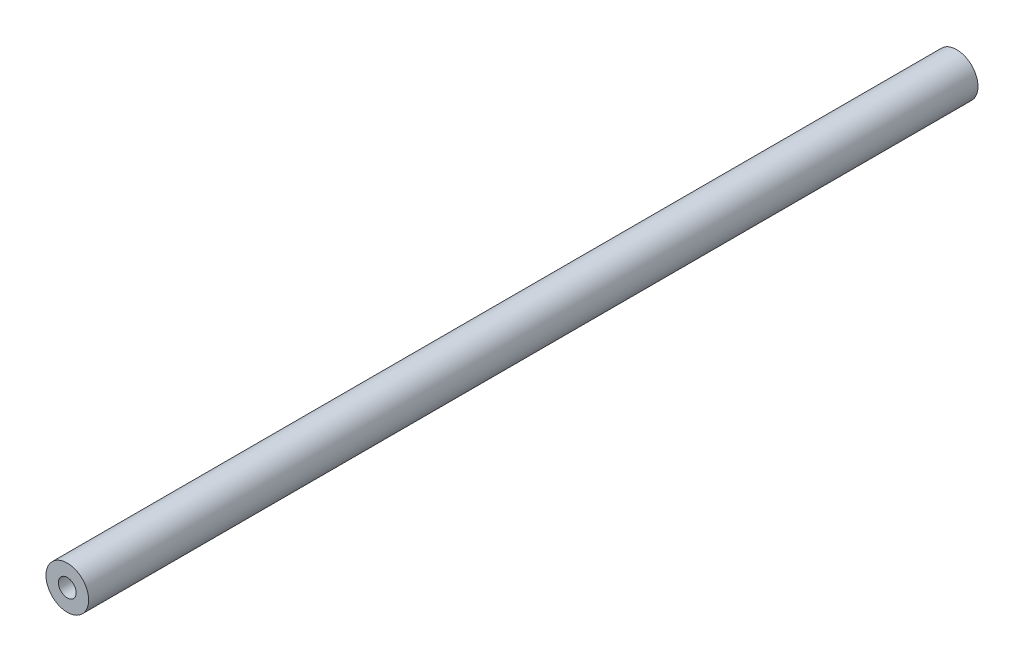
ISO-10303-21;
HEADER;
FILE_DESCRIPTION(('STEP AP214'),'2;1');
FILE_NAME('part.step','',(''),(''),'','','');
FILE_SCHEMA(('AUTOMOTIVE_DESIGN { 1 0 10303 214 1 1 1 1 }'));
ENDSEC;
DATA;
#1=APPLICATION_CONTEXT('core data for automotive mechanical design processes');
#2=APPLICATION_PROTOCOL_DEFINITION('international standard','automotive_design',2000,#1);
#3=PRODUCT_CONTEXT('',#1,'mechanical');
#4=PRODUCT('Part','Part','',(#3));
#5=PRODUCT_RELATED_PRODUCT_CATEGORY('part','',(#4));
#6=PRODUCT_DEFINITION_FORMATION('','',#4);
#7=PRODUCT_DEFINITION_CONTEXT('part definition',#1,'design');
#8=PRODUCT_DEFINITION('design','',#6,#7);
#9=PRODUCT_DEFINITION_SHAPE('','',#8);
#10=(LENGTH_UNIT() NAMED_UNIT(*) SI_UNIT(.MILLI.,.METRE.));
#11=(NAMED_UNIT(*) PLANE_ANGLE_UNIT() SI_UNIT($,.RADIAN.));
#12=(NAMED_UNIT(*) SI_UNIT($,.STERADIAN.) SOLID_ANGLE_UNIT());
#13=UNCERTAINTY_MEASURE_WITH_UNIT(LENGTH_MEASURE(1.E-05),#10,'distance_accuracy_value','');
#14=(GEOMETRIC_REPRESENTATION_CONTEXT(3) GLOBAL_UNCERTAINTY_ASSIGNED_CONTEXT((#13)) GLOBAL_UNIT_ASSIGNED_CONTEXT((#10,
#11,#12)) REPRESENTATION_CONTEXT('',''));
#15=CARTESIAN_POINT('',(0.,0.,0.));
#16=DIRECTION('',(0.,0.,1.));
#17=DIRECTION('',(1.,0.,0.));
#18=AXIS2_PLACEMENT_3D('',#15,#16,#17);
#19=CARTESIAN_POINT('',(0.,0.,250.));
#20=DIRECTION('',(0.,0.,-1.));
#21=DIRECTION('',(-1.,0.,0.));
#22=AXIS2_PLACEMENT_3D('',#19,#20,#21);
#23=CYLINDRICAL_SURFACE('',#22,6.);
#24=CARTESIAN_POINT('',(0.,0.,250.));
#25=DIRECTION('',(0.,0.,1.));
#26=DIRECTION('',(1.,0.,0.));
#27=AXIS2_PLACEMENT_3D('',#24,#25,#26);
#28=CIRCLE('',#27,6.);
#29=CARTESIAN_POINT('',(6.,0.,250.));
#30=VERTEX_POINT('',#29);
#31=EDGE_CURVE('E10',#30,#30,#28,.T.);
#32=ORIENTED_EDGE('',*,*,#31,.F.);
#33=EDGE_LOOP('',(#32));
#34=FACE_BOUND('',#33,.T.);
#35=CARTESIAN_POINT('',(0.,0.,0.));
#36=DIRECTION('',(0.,0.,1.));
#37=DIRECTION('',(1.,0.,0.));
#38=AXIS2_PLACEMENT_3D('',#35,#36,#37);
#39=CIRCLE('',#38,6.);
#40=CARTESIAN_POINT('',(6.,0.,0.));
#41=VERTEX_POINT('',#40);
#42=EDGE_CURVE('E40',#41,#41,#39,.T.);
#43=ORIENTED_EDGE('',*,*,#42,.T.);
#44=EDGE_LOOP('',(#43));
#45=FACE_BOUND('',#44,.T.);
#46=ADVANCED_FACE('F37',(#34,#45),#23,.T.);
#47=CARTESIAN_POINT('',(0.,0.,250.));
#48=DIRECTION('',(0.,0.,1.));
#49=DIRECTION('',(1.,0.,0.));
#50=AXIS2_PLACEMENT_3D('',#47,#48,#49);
#51=PLANE('',#50);
#52=CARTESIAN_POINT('',(0.,0.,250.));
#53=DIRECTION('',(0.,0.,1.));
#54=DIRECTION('',(1.,0.,0.));
#55=AXIS2_PLACEMENT_3D('',#52,#53,#54);
#56=CIRCLE('',#55,2.5);
#57=CARTESIAN_POINT('',(2.5,0.,250.));
#58=VERTEX_POINT('',#57);
#59=EDGE_CURVE('E51',#58,#58,#56,.T.);
#60=ORIENTED_EDGE('',*,*,#59,.F.);
#61=EDGE_LOOP('',(#60));
#62=FACE_BOUND('',#61,.T.);
#63=ORIENTED_EDGE('',*,*,#31,.T.);
#64=EDGE_LOOP('',(#63));
#65=FACE_BOUND('',#64,.T.);
#66=ADVANCED_FACE('F80',(#62,#65),#51,.T.);
#67=CARTESIAN_POINT('',(0.,0.,0.));
#68=DIRECTION('',(0.,0.,1.));
#69=DIRECTION('',(1.,0.,0.));
#70=AXIS2_PLACEMENT_3D('',#67,#68,#69);
#71=PLANE('',#70);
#72=CARTESIAN_POINT('',(0.,0.,0.));
#73=DIRECTION('',(0.,0.,-1.));
#74=DIRECTION('',(-1.,0.,0.));
#75=AXIS2_PLACEMENT_3D('',#72,#73,#74);
#76=CIRCLE('',#75,2.5);
#77=CARTESIAN_POINT('',(-2.5,0.,0.));
#78=VERTEX_POINT('',#77);
#79=EDGE_CURVE('E59',#78,#78,#76,.T.);
#80=ORIENTED_EDGE('',*,*,#79,.F.);
#81=EDGE_LOOP('',(#80));
#82=FACE_BOUND('',#81,.T.);
#83=ORIENTED_EDGE('',*,*,#42,.F.);
#84=EDGE_LOOP('',(#83));
#85=FACE_BOUND('',#84,.T.);
#86=ADVANCED_FACE('F76',(#82,#85),#71,.F.);
#87=CARTESIAN_POINT('',(0.,0.,235.));
#88=DIRECTION('',(0.,0.,1.));
#89=DIRECTION('',(1.,0.,0.));
#90=AXIS2_PLACEMENT_3D('',#87,#88,#89);
#91=CYLINDRICAL_SURFACE('',#90,2.5);
#92=CARTESIAN_POINT('',(0.,0.,235.));
#93=DIRECTION('',(0.,0.,1.));
#94=DIRECTION('',(1.,0.,0.));
#95=AXIS2_PLACEMENT_3D('',#92,#93,#94);
#96=CIRCLE('',#95,2.5);
#97=CARTESIAN_POINT('',(2.5,0.,235.));
#98=VERTEX_POINT('',#97);
#99=EDGE_CURVE('E49',#98,#98,#96,.T.);
#100=ORIENTED_EDGE('',*,*,#99,.F.);
#101=EDGE_LOOP('',(#100));
#102=FACE_BOUND('',#101,.T.);
#103=ORIENTED_EDGE('',*,*,#59,.T.);
#104=EDGE_LOOP('',(#103));
#105=FACE_BOUND('',#104,.T.);
#106=ADVANCED_FACE('F79',(#102,#105),#91,.F.);
#107=CARTESIAN_POINT('',(0.,0.,235.));
#108=DIRECTION('',(0.,0.,1.));
#109=DIRECTION('',(1.,0.,0.));
#110=AXIS2_PLACEMENT_3D('',#107,#108,#109);
#111=PLANE('',#110);
#112=ORIENTED_EDGE('',*,*,#99,.T.);
#113=EDGE_LOOP('',(#112));
#114=FACE_BOUND('',#113,.T.);
#115=ADVANCED_FACE('F72',(#114),#111,.T.);
#116=CARTESIAN_POINT('',(0.,0.,15.));
#117=DIRECTION('',(0.,0.,-1.));
#118=DIRECTION('',(-1.,0.,0.));
#119=AXIS2_PLACEMENT_3D('',#116,#117,#118);
#120=CYLINDRICAL_SURFACE('',#119,2.5);
#121=CARTESIAN_POINT('',(0.,0.,15.));
#122=DIRECTION('',(0.,0.,-1.));
#123=DIRECTION('',(-1.,0.,0.));
#124=AXIS2_PLACEMENT_3D('',#121,#122,#123);
#125=CIRCLE('',#124,2.5);
#126=CARTESIAN_POINT('',(-2.5,0.,15.));
#127=VERTEX_POINT('',#126);
#128=EDGE_CURVE('E55',#127,#127,#125,.T.);
#129=ORIENTED_EDGE('',*,*,#128,.F.);
#130=EDGE_LOOP('',(#129));
#131=FACE_BOUND('',#130,.T.);
#132=ORIENTED_EDGE('',*,*,#79,.T.);
#133=EDGE_LOOP('',(#132));
#134=FACE_BOUND('',#133,.T.);
#135=ADVANCED_FACE('F69',(#131,#134),#120,.F.);
#136=CARTESIAN_POINT('',(0.,0.,15.));
#137=DIRECTION('',(0.,0.,-1.));
#138=DIRECTION('',(-1.,0.,0.));
#139=AXIS2_PLACEMENT_3D('',#136,#137,#138);
#140=PLANE('',#139);
#141=ORIENTED_EDGE('',*,*,#128,.T.);
#142=EDGE_LOOP('',(#141));
#143=FACE_BOUND('',#142,.T.);
#144=ADVANCED_FACE('F67',(#143),#140,.T.);
#145=CLOSED_SHELL('',(#46,#66,#86,#106,#115,#135,#144));
#146=MANIFOLD_SOLID_BREP('B2',#145);
#147=ADVANCED_BREP_SHAPE_REPRESENTATION('',(#18,#146),#14);
#148=SHAPE_DEFINITION_REPRESENTATION(#9,#147);
ENDSEC;
END-ISO-10303-21;
